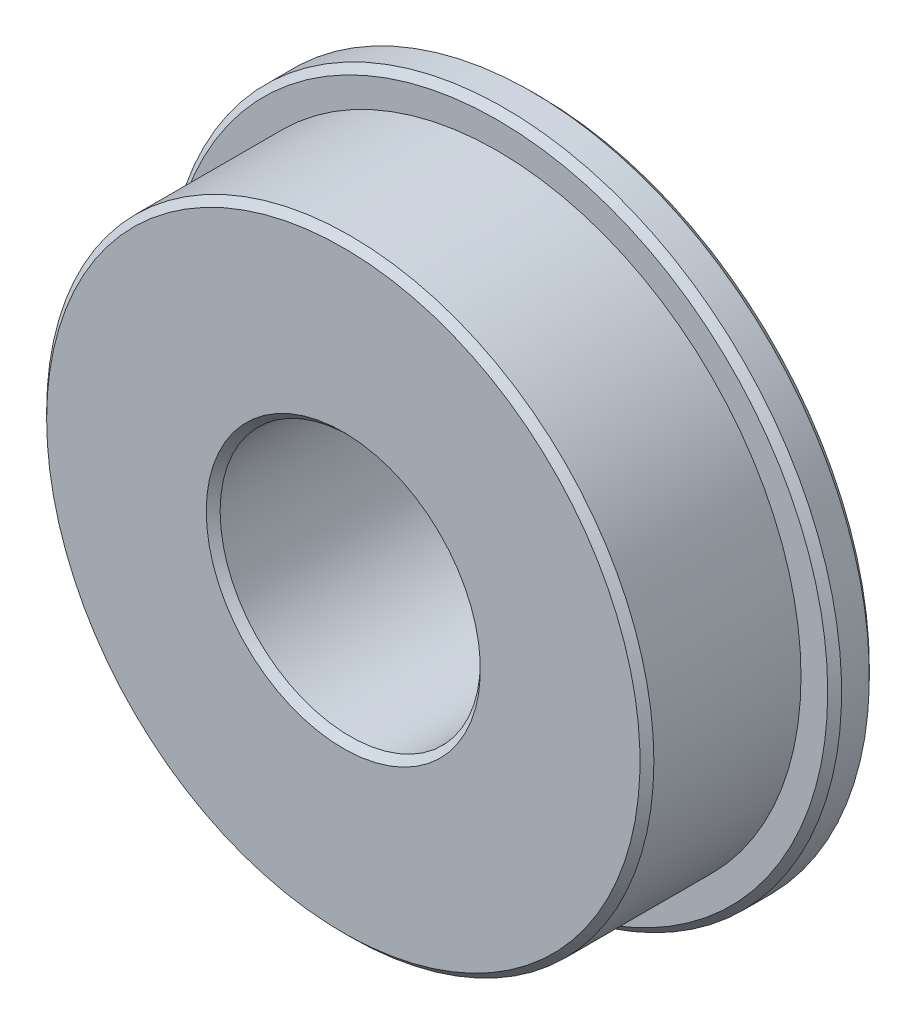
ISO-10303-21;
HEADER;
FILE_DESCRIPTION(('STEP AP214'),'2;1');
FILE_NAME('part.step','',(''),(''),'','','');
FILE_SCHEMA(('AUTOMOTIVE_DESIGN { 1 0 10303 214 1 1 1 1 }'));
ENDSEC;
DATA;
#1=APPLICATION_CONTEXT('core data for automotive mechanical design processes');
#2=APPLICATION_PROTOCOL_DEFINITION('international standard','automotive_design',2000,#1);
#3=PRODUCT_CONTEXT('',#1,'mechanical');
#4=PRODUCT('Part','Part','',(#3));
#5=PRODUCT_RELATED_PRODUCT_CATEGORY('part','',(#4));
#6=PRODUCT_DEFINITION_FORMATION('','',#4);
#7=PRODUCT_DEFINITION_CONTEXT('part definition',#1,'design');
#8=PRODUCT_DEFINITION('design','',#6,#7);
#9=PRODUCT_DEFINITION_SHAPE('','',#8);
#10=(LENGTH_UNIT() NAMED_UNIT(*) SI_UNIT(.MILLI.,.METRE.));
#11=(NAMED_UNIT(*) PLANE_ANGLE_UNIT() SI_UNIT($,.RADIAN.));
#12=(NAMED_UNIT(*) SI_UNIT($,.STERADIAN.) SOLID_ANGLE_UNIT());
#13=UNCERTAINTY_MEASURE_WITH_UNIT(LENGTH_MEASURE(1.E-05),#10,'distance_accuracy_value','');
#14=(GEOMETRIC_REPRESENTATION_CONTEXT(3) GLOBAL_UNCERTAINTY_ASSIGNED_CONTEXT((#13)) GLOBAL_UNIT_ASSIGNED_CONTEXT((#10,
#11,#12)) REPRESENTATION_CONTEXT('',''));
#15=CARTESIAN_POINT('',(0.,0.,0.));
#16=DIRECTION('',(0.,0.,1.));
#17=DIRECTION('',(1.,0.,0.));
#18=AXIS2_PLACEMENT_3D('',#15,#16,#17);
#19=CARTESIAN_POINT('',(-8.86153846153845,6.04195804195806,1.52399999999997));
#20=DIRECTION('',(0.,0.,1.));
#21=DIRECTION('',(-1.,0.,0.));
#22=AXIS2_PLACEMENT_3D('',#19,#20,#21);
#23=CYLINDRICAL_SURFACE('',#22,4.7625);
#24=CARTESIAN_POINT('',(-8.86153846153845,6.04195804195806,0.253999999999976));
#25=DIRECTION('',(0.,0.,-1.));
#26=DIRECTION('',(-1.,0.,0.));
#27=AXIS2_PLACEMENT_3D('',#24,#25,#26);
#28=CIRCLE('',#27,4.7625);
#29=CARTESIAN_POINT('',(-13.6240384615385,6.04195804195805,0.253999999999976));
#30=VERTEX_POINT('',#29);
#31=EDGE_CURVE('E11',#30,#30,#28,.T.);
#32=ORIENTED_EDGE('',*,*,#31,.T.);
#33=EDGE_LOOP('',(#32));
#34=FACE_BOUND('',#33,.T.);
#35=CARTESIAN_POINT('',(-8.86153846153845,6.04195804195806,6.90880000000005));
#36=DIRECTION('',(0.,0.,1.));
#37=DIRECTION('',(-1.,0.,0.));
#38=AXIS2_PLACEMENT_3D('',#35,#36,#37);
#39=CIRCLE('',#38,4.7625);
#40=CARTESIAN_POINT('',(-13.6240384615385,6.04195804195805,6.90880000000005));
#41=VERTEX_POINT('',#40);
#42=EDGE_CURVE('E27',#41,#41,#39,.T.);
#43=ORIENTED_EDGE('',*,*,#42,.T.);
#44=EDGE_LOOP('',(#43));
#45=FACE_BOUND('',#44,.T.);
#46=ADVANCED_FACE('F16',(#34,#45),#23,.F.);
#47=CARTESIAN_POINT('',(-8.86153846153845,6.04195804195806,1.52399999999997));
#48=DIRECTION('',(0.,0.,1.));
#49=DIRECTION('',(-1.,0.,0.));
#50=AXIS2_PLACEMENT_3D('',#47,#48,#49);
#51=CYLINDRICAL_SURFACE('',#50,12.3444);
#52=CARTESIAN_POINT('',(-8.86153846153845,6.04195804195806,0.253999999999976));
#53=DIRECTION('',(0.,0.,1.));
#54=DIRECTION('',(-1.,0.,0.));
#55=AXIS2_PLACEMENT_3D('',#52,#53,#54);
#56=CIRCLE('',#55,12.3444);
#57=CARTESIAN_POINT('',(-21.2059384615385,6.04195804195804,0.253999999999976));
#58=VERTEX_POINT('',#57);
#59=EDGE_CURVE('E88',#58,#58,#56,.T.);
#60=ORIENTED_EDGE('',*,*,#59,.T.);
#61=EDGE_LOOP('',(#60));
#62=FACE_BOUND('',#61,.T.);
#63=CARTESIAN_POINT('',(-8.86153846153845,6.04195804195806,1.26999999999999));
#64=DIRECTION('',(0.,0.,-1.));
#65=DIRECTION('',(-1.,0.,0.));
#66=AXIS2_PLACEMENT_3D('',#63,#64,#65);
#67=CIRCLE('',#66,12.3444);
#68=CARTESIAN_POINT('',(-21.2059384615385,6.04195804195804,1.26999999999999));
#69=VERTEX_POINT('',#68);
#70=EDGE_CURVE('E93',#69,#69,#67,.T.);
#71=ORIENTED_EDGE('',*,*,#70,.T.);
#72=EDGE_LOOP('',(#71));
#73=FACE_BOUND('',#72,.T.);
#74=ADVANCED_FACE('F145',(#62,#73),#51,.T.);
#75=CARTESIAN_POINT('',(-8.86153846153845,6.04195804195806,1.52399999999997));
#76=DIRECTION('',(0.,0.,-1.));
#77=DIRECTION('',(0.,-1.,0.));
#78=AXIS2_PLACEMENT_3D('',#75,#76,#77);
#79=PLANE('',#78);
#80=CARTESIAN_POINT('',(-8.86153846153845,6.04195804195806,1.52399999999997));
#81=DIRECTION('',(0.,0.,1.));
#82=DIRECTION('',(-1.,0.,0.));
#83=AXIS2_PLACEMENT_3D('',#80,#81,#82);
#84=CIRCLE('',#83,12.0904);
#85=CARTESIAN_POINT('',(-20.9519384615385,6.04195804195803,1.52399999999997));
#86=VERTEX_POINT('',#85);
#87=EDGE_CURVE('E20',#86,#86,#84,.T.);
#88=ORIENTED_EDGE('',*,*,#87,.T.);
#89=EDGE_LOOP('',(#88));
#90=FACE_BOUND('',#89,.T.);
#91=CARTESIAN_POINT('',(-8.86153846153845,6.04195804195806,1.52399999999997));
#92=DIRECTION('',(0.,0.,-1.));
#93=DIRECTION('',(0.,1.,0.));
#94=AXIS2_PLACEMENT_3D('',#91,#92,#93);
#95=CIRCLE('',#94,11.1125);
#96=CARTESIAN_POINT('',(-8.86153846153846,17.154458041958,1.52399999999997));
#97=VERTEX_POINT('',#96);
#98=EDGE_CURVE('E67',#97,#97,#95,.T.);
#99=ORIENTED_EDGE('',*,*,#98,.T.);
#100=EDGE_LOOP('',(#99));
#101=FACE_BOUND('',#100,.T.);
#102=ADVANCED_FACE('F150',(#90,#101),#79,.F.);
#103=CARTESIAN_POINT('',(-8.86153846153845,6.04195804195806,7.16280000000002));
#104=DIRECTION('',(0.,0.,1.));
#105=DIRECTION('',(-1.,0.,0.));
#106=AXIS2_PLACEMENT_3D('',#103,#104,#105);
#107=CYLINDRICAL_SURFACE('',#106,11.1125);
#108=CARTESIAN_POINT('',(-8.86153846153845,6.04195804195806,6.90880000000005));
#109=DIRECTION('',(0.,0.,-1.));
#110=DIRECTION('',(-1.,0.,0.));
#111=AXIS2_PLACEMENT_3D('',#108,#109,#110);
#112=CIRCLE('',#111,11.1125);
#113=CARTESIAN_POINT('',(-19.9740384615385,6.04195804195805,6.90880000000005));
#114=VERTEX_POINT('',#113);
#115=EDGE_CURVE('E77',#114,#114,#112,.T.);
#116=ORIENTED_EDGE('',*,*,#115,.T.);
#117=EDGE_LOOP('',(#116));
#118=FACE_BOUND('',#117,.T.);
#119=ORIENTED_EDGE('',*,*,#98,.F.);
#120=EDGE_LOOP('',(#119));
#121=FACE_BOUND('',#120,.T.);
#122=ADVANCED_FACE('F154',(#118,#121),#107,.T.);
#123=CARTESIAN_POINT('',(-8.86153846153845,6.04195804195806,7.16280000000002));
#124=DIRECTION('',(0.,0.,-1.));
#125=DIRECTION('',(0.,-1.,0.));
#126=AXIS2_PLACEMENT_3D('',#123,#124,#125);
#127=PLANE('',#126);
#128=CARTESIAN_POINT('',(-8.86153846153845,6.04195804195806,7.16280000000002));
#129=DIRECTION('',(0.,0.,-1.));
#130=DIRECTION('',(-1.,0.,0.));
#131=AXIS2_PLACEMENT_3D('',#128,#129,#130);
#132=CIRCLE('',#131,5.0165);
#133=CARTESIAN_POINT('',(-13.8780384615385,6.04195804195805,7.16280000000002));
#134=VERTEX_POINT('',#133);
#135=EDGE_CURVE('E111',#134,#134,#132,.T.);
#136=ORIENTED_EDGE('',*,*,#135,.T.);
#137=EDGE_LOOP('',(#136));
#138=FACE_BOUND('',#137,.T.);
#139=CARTESIAN_POINT('',(-8.86153846153845,6.04195804195806,7.16280000000002));
#140=DIRECTION('',(0.,0.,1.));
#141=DIRECTION('',(-1.,0.,0.));
#142=AXIS2_PLACEMENT_3D('',#139,#140,#141);
#143=CIRCLE('',#142,10.8585);
#144=CARTESIAN_POINT('',(-19.7200384615385,6.04195804195804,7.16280000000002));
#145=VERTEX_POINT('',#144);
#146=EDGE_CURVE('E109',#145,#145,#143,.T.);
#147=ORIENTED_EDGE('',*,*,#146,.T.);
#148=EDGE_LOOP('',(#147));
#149=FACE_BOUND('',#148,.T.);
#150=ADVANCED_FACE('F157',(#138,#149),#127,.F.);
#151=CARTESIAN_POINT('',(-8.86153846153845,6.04195804195806,0.));
#152=DIRECTION('',(0.,0.,-1.));
#153=DIRECTION('',(0.,-1.,0.));
#154=AXIS2_PLACEMENT_3D('',#151,#152,#153);
#155=PLANE('',#154);
#156=CARTESIAN_POINT('',(-8.86153846153845,6.04195804195806,0.));
#157=DIRECTION('',(0.,0.,1.));
#158=DIRECTION('',(-1.,0.,0.));
#159=AXIS2_PLACEMENT_3D('',#156,#157,#158);
#160=CIRCLE('',#159,5.0165);
#161=CARTESIAN_POINT('',(-13.8780384615385,6.04195804195805,0.));
#162=VERTEX_POINT('',#161);
#163=EDGE_CURVE('E106',#162,#162,#160,.T.);
#164=ORIENTED_EDGE('',*,*,#163,.T.);
#165=EDGE_LOOP('',(#164));
#166=FACE_BOUND('',#165,.T.);
#167=CARTESIAN_POINT('',(-8.86153846153845,6.04195804195806,0.));
#168=DIRECTION('',(0.,0.,-1.));
#169=DIRECTION('',(-1.,0.,0.));
#170=AXIS2_PLACEMENT_3D('',#167,#168,#169);
#171=CIRCLE('',#170,12.0904);
#172=CARTESIAN_POINT('',(-20.9519384615385,6.04195804195803,0.));
#173=VERTEX_POINT('',#172);
#174=EDGE_CURVE('E110',#173,#173,#171,.T.);
#175=ORIENTED_EDGE('',*,*,#174,.T.);
#176=EDGE_LOOP('',(#175));
#177=FACE_BOUND('',#176,.T.);
#178=ADVANCED_FACE('F129',(#166,#177),#155,.T.);
#179=CARTESIAN_POINT('',(-8.86153846153845,6.04195804195806,0.253999999999976));
#180=DIRECTION('',(0.,0.,-1.));
#181=DIRECTION('',(-1.,0.,0.));
#182=AXIS2_PLACEMENT_3D('',#179,#180,#181);
#183=CONICAL_SURFACE('',#182,4.7625,0.78539816339745);
#184=ORIENTED_EDGE('',*,*,#163,.F.);
#185=EDGE_LOOP('',(#184));
#186=FACE_BOUND('',#185,.T.);
#187=ORIENTED_EDGE('',*,*,#31,.F.);
#188=EDGE_LOOP('',(#187));
#189=FACE_BOUND('',#188,.T.);
#190=ADVANCED_FACE('F139',(#186,#189),#183,.F.);
#191=CARTESIAN_POINT('',(-8.86153846153845,6.04195804195806,7.16280000000002));
#192=DIRECTION('',(0.,0.,1.));
#193=DIRECTION('',(1.,0.,0.));
#194=AXIS2_PLACEMENT_3D('',#191,#192,#193);
#195=CONICAL_SURFACE('',#194,5.0165,0.785398163397448);
#196=ORIENTED_EDGE('',*,*,#42,.F.);
#197=EDGE_LOOP('',(#196));
#198=FACE_BOUND('',#197,.T.);
#199=ORIENTED_EDGE('',*,*,#135,.F.);
#200=EDGE_LOOP('',(#199));
#201=FACE_BOUND('',#200,.T.);
#202=ADVANCED_FACE('F131',(#198,#201),#195,.F.);
#203=CARTESIAN_POINT('',(-8.86153846153845,6.04195804195806,0.));
#204=DIRECTION('',(0.,0.,1.));
#205=DIRECTION('',(1.,0.,0.));
#206=AXIS2_PLACEMENT_3D('',#203,#204,#205);
#207=CONICAL_SURFACE('',#206,12.0904,0.78539816339745);
#208=ORIENTED_EDGE('',*,*,#59,.F.);
#209=EDGE_LOOP('',(#208));
#210=FACE_BOUND('',#209,.T.);
#211=ORIENTED_EDGE('',*,*,#174,.F.);
#212=EDGE_LOOP('',(#211));
#213=FACE_BOUND('',#212,.T.);
#214=ADVANCED_FACE('F89',(#210,#213),#207,.T.);
#215=CARTESIAN_POINT('',(-8.86153846153845,6.04195804195806,1.26999999999999));
#216=DIRECTION('',(0.,0.,-1.));
#217=DIRECTION('',(-1.,0.,0.));
#218=AXIS2_PLACEMENT_3D('',#215,#216,#217);
#219=CONICAL_SURFACE('',#218,12.3444,0.78539816339745);
#220=ORIENTED_EDGE('',*,*,#87,.F.);
#221=EDGE_LOOP('',(#220));
#222=FACE_BOUND('',#221,.T.);
#223=ORIENTED_EDGE('',*,*,#70,.F.);
#224=EDGE_LOOP('',(#223));
#225=FACE_BOUND('',#224,.T.);
#226=ADVANCED_FACE('F18',(#222,#225),#219,.T.);
#227=CARTESIAN_POINT('',(-8.86153846153845,6.04195804195806,6.90880000000005));
#228=DIRECTION('',(0.,0.,-1.));
#229=DIRECTION('',(-1.,0.,0.));
#230=AXIS2_PLACEMENT_3D('',#227,#228,#229);
#231=CONICAL_SURFACE('',#230,11.1125,0.78539816339745);
#232=ORIENTED_EDGE('',*,*,#146,.F.);
#233=EDGE_LOOP('',(#232));
#234=FACE_BOUND('',#233,.T.);
#235=ORIENTED_EDGE('',*,*,#115,.F.);
#236=EDGE_LOOP('',(#235));
#237=FACE_BOUND('',#236,.T.);
#238=ADVANCED_FACE('F138',(#234,#237),#231,.T.);
#239=CLOSED_SHELL('',(#46,#74,#102,#122,#150,#178,#190,#202,#214,#226,#238));
#240=MANIFOLD_SOLID_BREP('B1',#239);
#241=ADVANCED_BREP_SHAPE_REPRESENTATION('',(#18,#240),#14);
#242=SHAPE_DEFINITION_REPRESENTATION(#9,#241);
ENDSEC;
END-ISO-10303-21;
